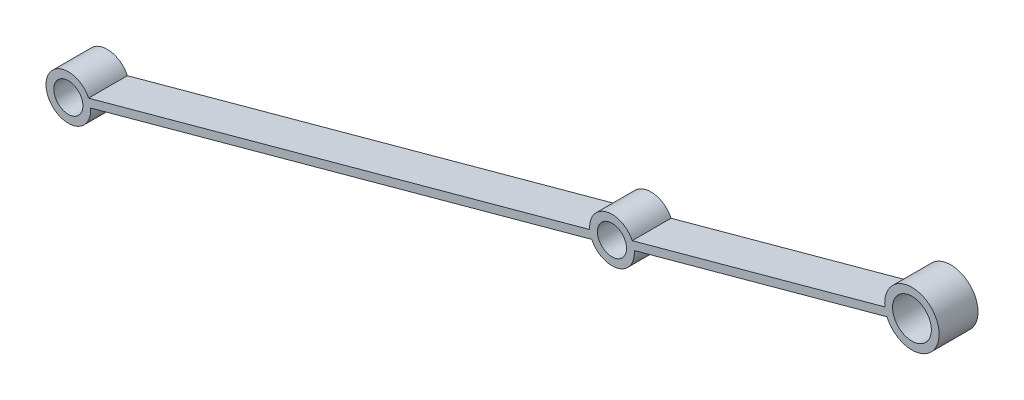
ISO-10303-21;
HEADER;
FILE_DESCRIPTION(('STEP AP214'),'2;1');
FILE_NAME('part.step','',(''),(''),'','','');
FILE_SCHEMA(('AUTOMOTIVE_DESIGN { 1 0 10303 214 1 1 1 1 }'));
ENDSEC;
DATA;
#1=APPLICATION_CONTEXT('core data for automotive mechanical design processes');
#2=APPLICATION_PROTOCOL_DEFINITION('international standard','automotive_design',2000,#1);
#3=PRODUCT_CONTEXT('',#1,'mechanical');
#4=PRODUCT('Part','Part','',(#3));
#5=PRODUCT_RELATED_PRODUCT_CATEGORY('part','',(#4));
#6=PRODUCT_DEFINITION_FORMATION('','',#4);
#7=PRODUCT_DEFINITION_CONTEXT('part definition',#1,'design');
#8=PRODUCT_DEFINITION('design','',#6,#7);
#9=PRODUCT_DEFINITION_SHAPE('','',#8);
#10=(LENGTH_UNIT() NAMED_UNIT(*) SI_UNIT(.MILLI.,.METRE.));
#11=(NAMED_UNIT(*) PLANE_ANGLE_UNIT() SI_UNIT($,.RADIAN.));
#12=(NAMED_UNIT(*) SI_UNIT($,.STERADIAN.) SOLID_ANGLE_UNIT());
#13=UNCERTAINTY_MEASURE_WITH_UNIT(LENGTH_MEASURE(1.E-05),#10,'distance_accuracy_value','');
#14=(GEOMETRIC_REPRESENTATION_CONTEXT(3) GLOBAL_UNCERTAINTY_ASSIGNED_CONTEXT((#13)) GLOBAL_UNIT_ASSIGNED_CONTEXT((#10,
#11,#12)) REPRESENTATION_CONTEXT('',''));
#15=CARTESIAN_POINT('',(0.,0.,0.));
#16=DIRECTION('',(0.,0.,1.));
#17=DIRECTION('',(1.,0.,0.));
#18=AXIS2_PLACEMENT_3D('',#15,#16,#17);
#19=CARTESIAN_POINT('',(-77.17683005113,-21.0650631914314,-10.));
#20=DIRECTION('',(0.,0.,1.));
#21=DIRECTION('',(1.,0.,0.));
#22=AXIS2_PLACEMENT_3D('',#19,#20,#21);
#23=CYLINDRICAL_SURFACE('',#22,5.75);
#24=DIRECTION('',(0.,0.,1.));
#25=VECTOR('',#24,1.);
#26=CARTESIAN_POINT('',(-82.3760694782836,-23.5207523776135,-10.));
#27=LINE('',#26,#25);
#28=CARTESIAN_POINT('',(-82.3760694782836,-23.5207523776135,-10.));
#29=VERTEX_POINT('',#28);
#30=CARTESIAN_POINT('',(-82.3760694782836,-23.5207523776135,0.));
#31=VERTEX_POINT('',#30);
#32=EDGE_CURVE('E43',#29,#31,#27,.T.);
#33=ORIENTED_EDGE('',*,*,#32,.F.);
#34=CARTESIAN_POINT('',(-77.17683005113,-21.0650631914314,-10.));
#35=DIRECTION('',(0.,0.,1.));
#36=DIRECTION('',(1.,0.,0.));
#37=AXIS2_PLACEMENT_3D('',#34,#35,#36);
#38=CIRCLE('',#37,5.75);
#39=CARTESIAN_POINT('',(-71.4509640435324,-20.5387947589394,-10.));
#40=VERTEX_POINT('',#39);
#41=EDGE_CURVE('E137',#29,#40,#38,.T.);
#42=ORIENTED_EDGE('',*,*,#41,.T.);
#43=DIRECTION('',(0.,0.,1.));
#44=VECTOR('',#43,1.);
#45=CARTESIAN_POINT('',(-71.4509640435323,-20.5387947589394,-10.));
#46=LINE('',#45,#44);
#47=CARTESIAN_POINT('',(-71.4509640435324,-20.5387947589394,0.));
#48=VERTEX_POINT('',#47);
#49=EDGE_CURVE('E141',#40,#48,#46,.T.);
#50=ORIENTED_EDGE('',*,*,#49,.T.);
#51=CARTESIAN_POINT('',(-77.17683005113,-21.0650631914314,0.));
#52=DIRECTION('',(0.,0.,1.));
#53=DIRECTION('',(1.,0.,0.));
#54=AXIS2_PLACEMENT_3D('',#51,#52,#53);
#55=CIRCLE('',#54,5.75);
#56=EDGE_CURVE('E118',#31,#48,#55,.T.);
#57=ORIENTED_EDGE('',*,*,#56,.F.);
#58=EDGE_LOOP('',(#33,#42,#50,#57));
#59=FACE_BOUND('',#58,.T.);
#60=ADVANCED_FACE('F35',(#59),#23,.T.);
#61=CARTESIAN_POINT('',(0.,0.,-10.));
#62=DIRECTION('',(0.,0.,1.));
#63=DIRECTION('',(1.,0.,0.));
#64=AXIS2_PLACEMENT_3D('',#61,#62,#63);
#65=CYLINDRICAL_SURFACE('',#64,5.);
#66=CARTESIAN_POINT('',(0.,0.,0.));
#67=DIRECTION('',(0.,0.,1.));
#68=DIRECTION('',(1.,0.,0.));
#69=AXIS2_PLACEMENT_3D('',#66,#67,#68);
#70=CIRCLE('',#69,5.);
#71=CARTESIAN_POINT('',(5.,0.,0.));
#72=VERTEX_POINT('',#71);
#73=EDGE_CURVE('E154',#72,#72,#70,.T.);
#74=ORIENTED_EDGE('',*,*,#73,.T.);
#75=EDGE_LOOP('',(#74));
#76=FACE_BOUND('',#75,.T.);
#77=CARTESIAN_POINT('',(0.,0.,-10.));
#78=DIRECTION('',(0.,0.,1.));
#79=DIRECTION('',(1.,0.,0.));
#80=AXIS2_PLACEMENT_3D('',#77,#78,#79);
#81=CIRCLE('',#80,5.);
#82=CARTESIAN_POINT('',(5.,0.,-10.));
#83=VERTEX_POINT('',#82);
#84=EDGE_CURVE('E148',#83,#83,#81,.T.);
#85=ORIENTED_EDGE('',*,*,#84,.F.);
#86=EDGE_LOOP('',(#85));
#87=FACE_BOUND('',#86,.T.);
#88=ADVANCED_FACE('F200',(#76,#87),#65,.F.);
#89=CARTESIAN_POINT('',(-73.4268527281323,-21.0781045488434,-10.));
#90=DIRECTION('',(0.263313290222034,-0.964710376845013,0.));
#91=DIRECTION('',(0.964710376845013,0.263313290222034,0.));
#92=AXIS2_PLACEMENT_3D('',#89,#90,#91);
#93=PLANE('',#92);
#94=DIRECTION('',(0.,0.,1.));
#95=VECTOR('',#94,1.);
#96=CARTESIAN_POINT('',(-6.42039625891589,-2.78899836473579,-10.));
#97=LINE('',#96,#95);
#98=CARTESIAN_POINT('',(-6.42039625891589,-2.78899836473579,0.));
#99=VERTEX_POINT('',#98);
#100=CARTESIAN_POINT('',(-6.42039625891589,-2.78899836473579,-10.));
#101=VERTEX_POINT('',#100);
#102=EDGE_CURVE('E129',#99,#101,#97,.F.);
#103=ORIENTED_EDGE('',*,*,#102,.F.);
#104=DIRECTION('',(0.964710376845013,0.263313290222034,0.));
#105=VECTOR('',#104,1.);
#106=CARTESIAN_POINT('',(-73.4268527281323,-21.0781045488434,0.));
#107=LINE('',#106,#105);
#108=EDGE_CURVE('E151',#48,#99,#107,.T.);
#109=ORIENTED_EDGE('',*,*,#108,.F.);
#110=ORIENTED_EDGE('',*,*,#49,.F.);
#111=DIRECTION('',(0.964710376845013,0.263313290222034,0.));
#112=VECTOR('',#111,1.);
#113=CARTESIAN_POINT('',(-73.4268527281323,-21.0781045488434,-10.));
#114=LINE('',#113,#112);
#115=EDGE_CURVE('E162',#40,#101,#114,.T.);
#116=ORIENTED_EDGE('',*,*,#115,.T.);
#117=EDGE_LOOP('',(#103,#109,#110,#116));
#118=FACE_BOUND('',#117,.T.);
#119=ADVANCED_FACE('F196',(#118),#93,.T.);
#120=CARTESIAN_POINT('',(-77.17683005113,-21.0650631914314,-10.));
#121=DIRECTION('',(0.,0.,1.));
#122=DIRECTION('',(1.,0.,0.));
#123=AXIS2_PLACEMENT_3D('',#120,#121,#122);
#124=CYLINDRICAL_SURFACE('',#123,3.75);
#125=CARTESIAN_POINT('',(-77.17683005113,-21.0650631914314,0.));
#126=DIRECTION('',(0.,0.,1.));
#127=DIRECTION('',(1.,0.,0.));
#128=AXIS2_PLACEMENT_3D('',#125,#126,#127);
#129=CIRCLE('',#128,3.75);
#130=CARTESIAN_POINT('',(-73.42683005113,-21.0650631914314,0.));
#131=VERTEX_POINT('',#130);
#132=EDGE_CURVE('E147',#131,#131,#129,.T.);
#133=ORIENTED_EDGE('',*,*,#132,.T.);
#134=EDGE_LOOP('',(#133));
#135=FACE_BOUND('',#134,.T.);
#136=CARTESIAN_POINT('',(-77.17683005113,-21.0650631914314,-10.));
#137=DIRECTION('',(0.,0.,1.));
#138=DIRECTION('',(1.,0.,0.));
#139=AXIS2_PLACEMENT_3D('',#136,#137,#138);
#140=CIRCLE('',#139,3.75);
#141=CARTESIAN_POINT('',(-73.42683005113,-21.0650631914314,-10.));
#142=VERTEX_POINT('',#141);
#143=EDGE_CURVE('E159',#142,#142,#140,.T.);
#144=ORIENTED_EDGE('',*,*,#143,.F.);
#145=EDGE_LOOP('',(#144));
#146=FACE_BOUND('',#145,.T.);
#147=ADVANCED_FACE('F224',(#135,#146),#124,.F.);
#148=CARTESIAN_POINT('',(-4.98940963589874,-0.325256030229714,-10.));
#149=DIRECTION('',(-0.263313290222034,0.964710376845013,0.));
#150=DIRECTION('',(-0.964710376845013,-0.263313290222034,0.));
#151=AXIS2_PLACEMENT_3D('',#148,#149,#150);
#152=PLANE('',#151);
#153=DIRECTION('',(0.,0.,1.));
#154=VECTOR('',#153,1.);
#155=CARTESIAN_POINT('',(-6.94702283935996,-0.859577611045758,-10.));
#156=LINE('',#155,#154);
#157=CARTESIAN_POINT('',(-6.94702283935996,-0.859577611045758,-10.));
#158=VERTEX_POINT('',#157);
#159=CARTESIAN_POINT('',(-6.94702283935996,-0.859577611045758,0.));
#160=VERTEX_POINT('',#159);
#161=EDGE_CURVE('E180',#158,#160,#156,.T.);
#162=ORIENTED_EDGE('',*,*,#161,.F.);
#163=DIRECTION('',(-0.964710376845013,-0.263313290222034,0.));
#164=VECTOR('',#163,1.);
#165=CARTESIAN_POINT('',(-4.98940963589874,-0.325256030229714,-10.));
#166=LINE('',#165,#164);
#167=CARTESIAN_POINT('',(-71.9775906239764,-18.6093740052493,-10.));
#168=VERTEX_POINT('',#167);
#169=EDGE_CURVE('E144',#158,#168,#166,.T.);
#170=ORIENTED_EDGE('',*,*,#169,.T.);
#171=DIRECTION('',(0.,0.,1.));
#172=VECTOR('',#171,1.);
#173=CARTESIAN_POINT('',(-71.9775906239764,-18.6093740052493,-10.));
#174=LINE('',#173,#172);
#175=CARTESIAN_POINT('',(-71.9775906239764,-18.6093740052493,0.));
#176=VERTEX_POINT('',#175);
#177=EDGE_CURVE('E136',#176,#168,#174,.F.);
#178=ORIENTED_EDGE('',*,*,#177,.F.);
#179=DIRECTION('',(-0.964710376845013,-0.263313290222034,0.));
#180=VECTOR('',#179,1.);
#181=CARTESIAN_POINT('',(-4.98940963589874,-0.325256030229714,0.));
#182=LINE('',#181,#180);
#183=EDGE_CURVE('E145',#160,#176,#182,.T.);
#184=ORIENTED_EDGE('',*,*,#183,.F.);
#185=EDGE_LOOP('',(#162,#170,#178,#184));
#186=FACE_BOUND('',#185,.T.);
#187=ADVANCED_FACE('F179',(#186),#152,.T.);
#188=CARTESIAN_POINT('',(0.,0.,-10.));
#189=DIRECTION('',(0.,0.,1.));
#190=DIRECTION('',(1.,0.,0.));
#191=AXIS2_PLACEMENT_3D('',#188,#189,#190);
#192=PLANE('',#191);
#193=ORIENTED_EDGE('',*,*,#84,.T.);
#194=EDGE_LOOP('',(#193));
#195=FACE_BOUND('',#194,.T.);
#196=ORIENTED_EDGE('',*,*,#143,.T.);
#197=EDGE_LOOP('',(#196));
#198=FACE_BOUND('',#197,.T.);
#199=DIRECTION('',(0.964710376845013,0.263313290222034,0.));
#200=VECTOR('',#199,1.);
#201=CARTESIAN_POINT('',(-213.30985746713,-59.2585316573697,-10.));
#202=LINE('',#201,#200);
#203=CARTESIAN_POINT('',(-211.33396878253,-58.7192218674657,-10.));
#204=VERTEX_POINT('',#203);
#205=EDGE_CURVE('E132',#204,#29,#202,.T.);
#206=ORIENTED_EDGE('',*,*,#205,.F.);
#207=CARTESIAN_POINT('',(-217.059834790128,-59.2454902999577,-10.));
#208=DIRECTION('',(0.,0.,1.));
#209=DIRECTION('',(1.,0.,0.));
#210=AXIS2_PLACEMENT_3D('',#207,#208,#209);
#211=CIRCLE('',#210,5.75000000000001);
#212=CARTESIAN_POINT('',(-211.860595362974,-56.7898011137757,-10.));
#213=VERTEX_POINT('',#212);
#214=EDGE_CURVE('E101',#213,#204,#211,.T.);
#215=ORIENTED_EDGE('',*,*,#214,.F.);
#216=DIRECTION('',(-0.964710376845013,-0.263313290222034,0.));
#217=VECTOR('',#216,1.);
#218=CARTESIAN_POINT('',(-80.9268073741277,-21.0520218340195,-10.));
#219=LINE('',#218,#217);
#220=CARTESIAN_POINT('',(-82.9026960587277,-21.5913316239235,-10.));
#221=VERTEX_POINT('',#220);
#222=EDGE_CURVE('E50',#221,#213,#219,.T.);
#223=ORIENTED_EDGE('',*,*,#222,.F.);
#224=EDGE_CURVE('E134',#168,#221,#38,.T.);
#225=ORIENTED_EDGE('',*,*,#224,.F.);
#226=ORIENTED_EDGE('',*,*,#169,.F.);
#227=CARTESIAN_POINT('',(0.,0.,-10.));
#228=DIRECTION('',(0.,0.,1.));
#229=DIRECTION('',(1.,0.,0.));
#230=AXIS2_PLACEMENT_3D('',#227,#228,#229);
#231=CIRCLE('',#230,7.);
#232=EDGE_CURVE('E183',#101,#158,#231,.T.);
#233=ORIENTED_EDGE('',*,*,#232,.F.);
#234=ORIENTED_EDGE('',*,*,#115,.F.);
#235=ORIENTED_EDGE('',*,*,#41,.F.);
#236=EDGE_LOOP('',(#206,#215,#223,#225,#226,#233,#234,#235));
#237=FACE_BOUND('',#236,.T.);
#238=CARTESIAN_POINT('',(-217.059834790128,-59.2454902999577,-10.));
#239=DIRECTION('',(0.,0.,1.));
#240=DIRECTION('',(1.,0.,0.));
#241=AXIS2_PLACEMENT_3D('',#238,#239,#240);
#242=CIRCLE('',#241,3.75000000000002);
#243=CARTESIAN_POINT('',(-213.309834790128,-59.2454902999577,-10.));
#244=VERTEX_POINT('',#243);
#245=EDGE_CURVE('E128',#244,#244,#242,.T.);
#246=ORIENTED_EDGE('',*,*,#245,.T.);
#247=EDGE_LOOP('',(#246));
#248=FACE_BOUND('',#247,.T.);
#249=ADVANCED_FACE('F37',(#195,#198,#237,#248),#192,.F.);
#250=CARTESIAN_POINT('',(0.,0.,0.));
#251=DIRECTION('',(0.,0.,1.));
#252=DIRECTION('',(1.,0.,0.));
#253=AXIS2_PLACEMENT_3D('',#250,#251,#252);
#254=PLANE('',#253);
#255=DIRECTION('',(-0.964710376845013,-0.263313290222034,0.));
#256=VECTOR('',#255,1.);
#257=CARTESIAN_POINT('',(-80.9268073741277,-21.0520218340195,0.));
#258=LINE('',#257,#256);
#259=CARTESIAN_POINT('',(-82.9026960587277,-21.5913316239235,0.));
#260=VERTEX_POINT('',#259);
#261=CARTESIAN_POINT('',(-211.860595362974,-56.7898011137757,0.));
#262=VERTEX_POINT('',#261);
#263=EDGE_CURVE('E113',#260,#262,#258,.T.);
#264=ORIENTED_EDGE('',*,*,#263,.T.);
#265=CARTESIAN_POINT('',(-217.059834790128,-59.2454902999577,0.));
#266=DIRECTION('',(0.,0.,1.));
#267=DIRECTION('',(1.,0.,0.));
#268=AXIS2_PLACEMENT_3D('',#265,#266,#267);
#269=CIRCLE('',#268,5.75000000000001);
#270=CARTESIAN_POINT('',(-211.33396878253,-58.7192218674657,0.));
#271=VERTEX_POINT('',#270);
#272=EDGE_CURVE('E99',#262,#271,#269,.T.);
#273=ORIENTED_EDGE('',*,*,#272,.T.);
#274=DIRECTION('',(0.964710376845013,0.263313290222034,0.));
#275=VECTOR('',#274,1.);
#276=CARTESIAN_POINT('',(-213.30985746713,-59.2585316573697,0.));
#277=LINE('',#276,#275);
#278=EDGE_CURVE('E110',#271,#31,#277,.T.);
#279=ORIENTED_EDGE('',*,*,#278,.T.);
#280=ORIENTED_EDGE('',*,*,#56,.T.);
#281=ORIENTED_EDGE('',*,*,#108,.T.);
#282=CARTESIAN_POINT('',(0.,0.,0.));
#283=DIRECTION('',(0.,0.,1.));
#284=DIRECTION('',(1.,0.,0.));
#285=AXIS2_PLACEMENT_3D('',#282,#283,#284);
#286=CIRCLE('',#285,7.);
#287=EDGE_CURVE('E105',#99,#160,#286,.T.);
#288=ORIENTED_EDGE('',*,*,#287,.T.);
#289=ORIENTED_EDGE('',*,*,#183,.T.);
#290=EDGE_CURVE('E121',#176,#260,#55,.T.);
#291=ORIENTED_EDGE('',*,*,#290,.T.);
#292=EDGE_LOOP('',(#264,#273,#279,#280,#281,#288,#289,#291));
#293=FACE_BOUND('',#292,.T.);
#294=ORIENTED_EDGE('',*,*,#73,.F.);
#295=EDGE_LOOP('',(#294));
#296=FACE_BOUND('',#295,.T.);
#297=ORIENTED_EDGE('',*,*,#132,.F.);
#298=EDGE_LOOP('',(#297));
#299=FACE_BOUND('',#298,.T.);
#300=CARTESIAN_POINT('',(-217.059834790128,-59.2454902999577,0.));
#301=DIRECTION('',(0.,0.,1.));
#302=DIRECTION('',(1.,0.,0.));
#303=AXIS2_PLACEMENT_3D('',#300,#301,#302);
#304=CIRCLE('',#303,3.75000000000002);
#305=CARTESIAN_POINT('',(-213.309834790128,-59.2454902999577,0.));
#306=VERTEX_POINT('',#305);
#307=EDGE_CURVE('E119',#306,#306,#304,.T.);
#308=ORIENTED_EDGE('',*,*,#307,.F.);
#309=EDGE_LOOP('',(#308));
#310=FACE_BOUND('',#309,.T.);
#311=ADVANCED_FACE('F108',(#293,#296,#299,#310),#254,.T.);
#312=DIRECTION('',(0.,0.,1.));
#313=VECTOR('',#312,1.);
#314=CARTESIAN_POINT('',(-82.9026960587277,-21.5913316239235,-10.));
#315=LINE('',#314,#313);
#316=EDGE_CURVE('E157',#260,#221,#315,.F.);
#317=ORIENTED_EDGE('',*,*,#316,.F.);
#318=ORIENTED_EDGE('',*,*,#290,.F.);
#319=ORIENTED_EDGE('',*,*,#177,.T.);
#320=ORIENTED_EDGE('',*,*,#224,.T.);
#321=EDGE_LOOP('',(#317,#318,#319,#320));
#322=FACE_BOUND('',#321,.T.);
#323=ADVANCED_FACE('F174',(#322),#23,.T.);
#324=CARTESIAN_POINT('',(-213.30985746713,-59.2585316573697,-10.));
#325=DIRECTION('',(0.263313290222034,-0.964710376845013,0.));
#326=DIRECTION('',(0.964710376845013,0.263313290222034,0.));
#327=AXIS2_PLACEMENT_3D('',#324,#325,#326);
#328=PLANE('',#327);
#329=DIRECTION('',(0.,0.,1.));
#330=VECTOR('',#329,1.);
#331=CARTESIAN_POINT('',(-211.33396878253,-58.7192218674657,-10.));
#332=LINE('',#331,#330);
#333=EDGE_CURVE('E96',#204,#271,#332,.T.);
#334=ORIENTED_EDGE('',*,*,#333,.F.);
#335=ORIENTED_EDGE('',*,*,#205,.T.);
#336=ORIENTED_EDGE('',*,*,#32,.T.);
#337=ORIENTED_EDGE('',*,*,#278,.F.);
#338=EDGE_LOOP('',(#334,#335,#336,#337));
#339=FACE_BOUND('',#338,.T.);
#340=ADVANCED_FACE('F115',(#339),#328,.T.);
#341=CARTESIAN_POINT('',(-217.059834790128,-59.2454902999577,-10.));
#342=DIRECTION('',(0.,0.,1.));
#343=DIRECTION('',(1.,0.,0.));
#344=AXIS2_PLACEMENT_3D('',#341,#342,#343);
#345=CYLINDRICAL_SURFACE('',#344,3.75000000000002);
#346=ORIENTED_EDGE('',*,*,#307,.T.);
#347=EDGE_LOOP('',(#346));
#348=FACE_BOUND('',#347,.T.);
#349=ORIENTED_EDGE('',*,*,#245,.F.);
#350=EDGE_LOOP('',(#349));
#351=FACE_BOUND('',#350,.T.);
#352=ADVANCED_FACE('F215',(#348,#351),#345,.F.);
#353=CARTESIAN_POINT('',(-80.9268073741277,-21.0520218340195,-10.));
#354=DIRECTION('',(-0.263313290222035,0.964710376845013,0.));
#355=DIRECTION('',(-0.964710376845013,-0.263313290222035,0.));
#356=AXIS2_PLACEMENT_3D('',#353,#354,#355);
#357=PLANE('',#356);
#358=DIRECTION('',(0.,0.,1.));
#359=VECTOR('',#358,1.);
#360=CARTESIAN_POINT('',(-211.860595362974,-56.7898011137757,-10.));
#361=LINE('',#360,#359);
#362=EDGE_CURVE('E11',#262,#213,#361,.F.);
#363=ORIENTED_EDGE('',*,*,#362,.F.);
#364=ORIENTED_EDGE('',*,*,#263,.F.);
#365=ORIENTED_EDGE('',*,*,#316,.T.);
#366=ORIENTED_EDGE('',*,*,#222,.T.);
#367=EDGE_LOOP('',(#363,#364,#365,#366));
#368=FACE_BOUND('',#367,.T.);
#369=ADVANCED_FACE('F167',(#368),#357,.T.);
#370=CARTESIAN_POINT('',(0.,0.,-10.));
#371=DIRECTION('',(0.,0.,1.));
#372=DIRECTION('',(1.,0.,0.));
#373=AXIS2_PLACEMENT_3D('',#370,#371,#372);
#374=CYLINDRICAL_SURFACE('',#373,7.);
#375=ORIENTED_EDGE('',*,*,#287,.F.);
#376=ORIENTED_EDGE('',*,*,#102,.T.);
#377=ORIENTED_EDGE('',*,*,#232,.T.);
#378=ORIENTED_EDGE('',*,*,#161,.T.);
#379=EDGE_LOOP('',(#375,#376,#377,#378));
#380=FACE_BOUND('',#379,.T.);
#381=ADVANCED_FACE('F193',(#380),#374,.T.);
#382=CARTESIAN_POINT('',(-217.059834790128,-59.2454902999577,-10.));
#383=DIRECTION('',(0.,0.,1.));
#384=DIRECTION('',(1.,0.,0.));
#385=AXIS2_PLACEMENT_3D('',#382,#383,#384);
#386=CYLINDRICAL_SURFACE('',#385,5.75000000000001);
#387=ORIENTED_EDGE('',*,*,#214,.T.);
#388=ORIENTED_EDGE('',*,*,#333,.T.);
#389=ORIENTED_EDGE('',*,*,#272,.F.);
#390=ORIENTED_EDGE('',*,*,#362,.T.);
#391=EDGE_LOOP('',(#387,#388,#389,#390));
#392=FACE_BOUND('',#391,.T.);
#393=ADVANCED_FACE('F98',(#392),#386,.T.);
#394=CLOSED_SHELL('',(#60,#88,#119,#147,#187,#249,#311,#323,#340,#352,#369,#381,#393));
#395=MANIFOLD_SOLID_BREP('B2',#394);
#396=ADVANCED_BREP_SHAPE_REPRESENTATION('',(#18,#395),#14);
#397=SHAPE_DEFINITION_REPRESENTATION(#9,#396);
ENDSEC;
END-ISO-10303-21;
